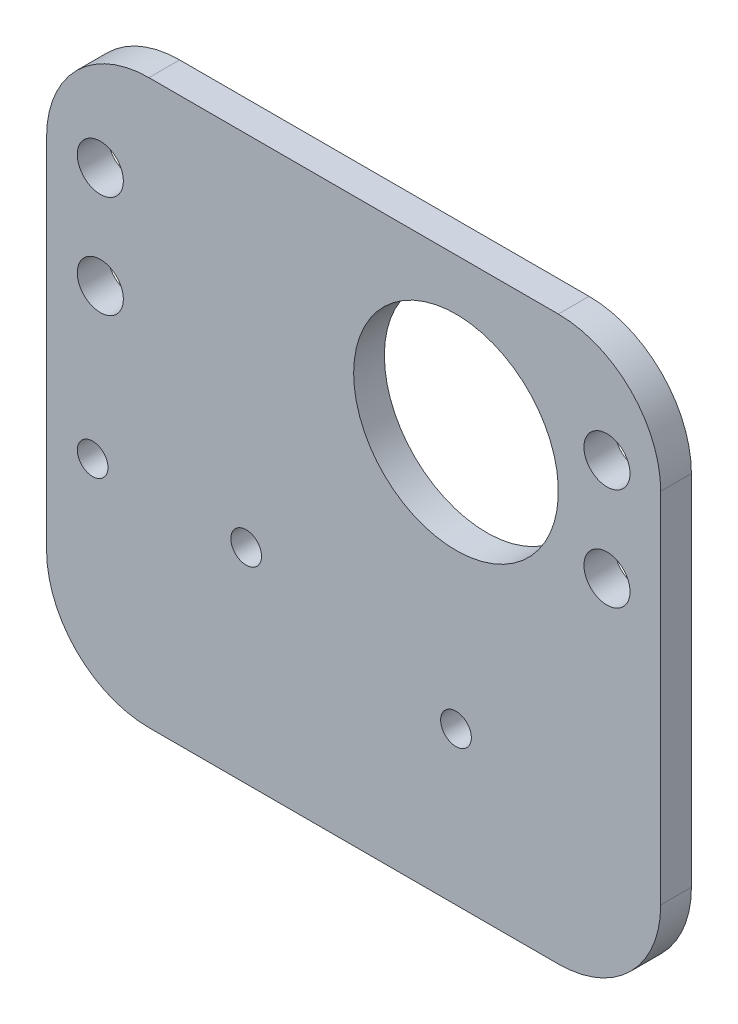
ISO-10303-21;
HEADER;
FILE_DESCRIPTION(('STEP AP214'),'2;1');
FILE_NAME('part.step','',(''),(''),'','','');
FILE_SCHEMA(('AUTOMOTIVE_DESIGN { 1 0 10303 214 1 1 1 1 }'));
ENDSEC;
DATA;
#1=APPLICATION_CONTEXT('core data for automotive mechanical design processes');
#2=APPLICATION_PROTOCOL_DEFINITION('international standard','automotive_design',2000,#1);
#3=PRODUCT_CONTEXT('',#1,'mechanical');
#4=PRODUCT('Part','Part','',(#3));
#5=PRODUCT_RELATED_PRODUCT_CATEGORY('part','',(#4));
#6=PRODUCT_DEFINITION_FORMATION('','',#4);
#7=PRODUCT_DEFINITION_CONTEXT('part definition',#1,'design');
#8=PRODUCT_DEFINITION('design','',#6,#7);
#9=PRODUCT_DEFINITION_SHAPE('','',#8);
#10=(LENGTH_UNIT() NAMED_UNIT(*) SI_UNIT(.MILLI.,.METRE.));
#11=(NAMED_UNIT(*) PLANE_ANGLE_UNIT() SI_UNIT($,.RADIAN.));
#12=(NAMED_UNIT(*) SI_UNIT($,.STERADIAN.) SOLID_ANGLE_UNIT());
#13=UNCERTAINTY_MEASURE_WITH_UNIT(LENGTH_MEASURE(1.E-05),#10,'distance_accuracy_value','');
#14=(GEOMETRIC_REPRESENTATION_CONTEXT(3) GLOBAL_UNCERTAINTY_ASSIGNED_CONTEXT((#13)) GLOBAL_UNIT_ASSIGNED_CONTEXT((#10,
#11,#12)) REPRESENTATION_CONTEXT('',''));
#15=CARTESIAN_POINT('',(0.,0.,0.));
#16=DIRECTION('',(0.,0.,1.));
#17=DIRECTION('',(1.,0.,0.));
#18=AXIS2_PLACEMENT_3D('',#15,#16,#17);
#19=CARTESIAN_POINT('',(0.,0.,0.001));
#20=DIRECTION('',(0.,0.,1.));
#21=DIRECTION('',(1.,0.,0.));
#22=AXIS2_PLACEMENT_3D('',#19,#20,#21);
#23=PLANE('',#22);
#24=CARTESIAN_POINT('',(45.5164785410153,-13.5674981786718,0.001));
#25=DIRECTION('',(0.,0.,-1.));
#26=DIRECTION('',(-1.,0.,0.));
#27=AXIS2_PLACEMENT_3D('',#24,#25,#26);
#28=CIRCLE('',#27,1.5);
#29=CARTESIAN_POINT('',(44.0164785410153,-13.5674981786718,0.001));
#30=VERTEX_POINT('',#29);
#31=EDGE_CURVE('E264',#30,#30,#28,.T.);
#32=ORIENTED_EDGE('',*,*,#31,.F.);
#33=EDGE_LOOP('',(#32));
#34=FACE_BOUND('',#33,.T.);
#35=CARTESIAN_POINT('',(45.5164785410153,-13.5674981786718,0.00100000000000013));
#36=DIRECTION('',(0.,0.,1.));
#37=DIRECTION('',(1.,0.,0.));
#38=AXIS2_PLACEMENT_3D('',#35,#36,#37);
#39=CIRCLE('',#38,5.5);
#40=CARTESIAN_POINT('',(51.0164785410153,-13.5674981786718,0.00100000000000013));
#41=VERTEX_POINT('',#40);
#42=EDGE_CURVE('E127',#41,#41,#39,.T.);
#43=ORIENTED_EDGE('',*,*,#42,.F.);
#44=EDGE_LOOP('',(#43));
#45=FACE_BOUND('',#44,.T.);
#46=ADVANCED_FACE('F35',(#34,#45),#23,.F.);
#47=CARTESIAN_POINT('',(45.5164785410153,-13.5674981786718,0.00100000000000013));
#48=DIRECTION('',(0.,0.,1.));
#49=DIRECTION('',(1.,0.,0.));
#50=AXIS2_PLACEMENT_3D('',#47,#48,#49);
#51=CIRCLE('',#50,7.5);
#52=CARTESIAN_POINT('',(53.0164785410153,-13.5674981786718,0.00100000000000013));
#53=VERTEX_POINT('',#52);
#54=EDGE_CURVE('E377',#53,#53,#51,.T.);
#55=ORIENTED_EDGE('',*,*,#54,.T.);
#56=EDGE_LOOP('',(#55));
#57=FACE_BOUND('',#56,.T.);
#58=CARTESIAN_POINT('',(10.0164785410153,-8.46749817867185,0.00100000000000013));
#59=DIRECTION('',(0.,0.,1.));
#60=DIRECTION('',(1.,0.,0.));
#61=AXIS2_PLACEMENT_3D('',#58,#59,#60);
#62=CIRCLE('',#61,1.5);
#63=CARTESIAN_POINT('',(11.5164785410153,-8.46749817867185,0.00100000000000013));
#64=VERTEX_POINT('',#63);
#65=EDGE_CURVE('E270',#64,#64,#62,.T.);
#66=ORIENTED_EDGE('',*,*,#65,.T.);
#67=EDGE_LOOP('',(#66));
#68=FACE_BOUND('',#67,.T.);
#69=CARTESIAN_POINT('',(25.0164785410153,-8.46749817867185,0.00100000000000013));
#70=DIRECTION('',(0.,0.,1.));
#71=DIRECTION('',(1.,0.,0.));
#72=AXIS2_PLACEMENT_3D('',#69,#70,#71);
#73=CIRCLE('',#72,1.5);
#74=CARTESIAN_POINT('',(26.5164785410153,-8.46749817867185,0.00100000000000013));
#75=VERTEX_POINT('',#74);
#76=EDGE_CURVE('E385',#75,#75,#73,.T.);
#77=ORIENTED_EDGE('',*,*,#76,.T.);
#78=EDGE_LOOP('',(#77));
#79=FACE_BOUND('',#78,.T.);
#80=CARTESIAN_POINT('',(45.5164785410153,11.5325018213282,0.001));
#81=DIRECTION('',(0.,0.,-1.));
#82=DIRECTION('',(-1.,0.,0.));
#83=AXIS2_PLACEMENT_3D('',#80,#81,#82);
#84=CIRCLE('',#83,10.);
#85=CARTESIAN_POINT('',(35.5164785410153,11.5325018213282,0.001));
#86=VERTEX_POINT('',#85);
#87=EDGE_CURVE('E263',#86,#86,#84,.T.);
#88=ORIENTED_EDGE('',*,*,#87,.F.);
#89=EDGE_LOOP('',(#88));
#90=FACE_BOUND('',#89,.T.);
#91=CARTESIAN_POINT('',(60.2664785410153,6.53250182132816,0.001));
#92=DIRECTION('',(0.,0.,1.));
#93=DIRECTION('',(1.,0.,0.));
#94=AXIS2_PLACEMENT_3D('',#91,#92,#93);
#95=CIRCLE('',#94,3.00000000000002);
#96=CARTESIAN_POINT('',(63.2664785410153,6.53250182132816,0.001));
#97=VERTEX_POINT('',#96);
#98=EDGE_CURVE('E187',#97,#97,#95,.F.);
#99=ORIENTED_EDGE('',*,*,#98,.F.);
#100=EDGE_LOOP('',(#99));
#101=FACE_BOUND('',#100,.T.);
#102=DIRECTION('',(1.,0.,0.));
#103=VECTOR('',#102,1.);
#104=CARTESIAN_POINT('',(5.51647854101529,26.5325018213282,0.001));
#105=LINE('',#104,#103);
#106=CARTESIAN_POINT('',(15.5164785410153,26.5325018213282,0.001));
#107=VERTEX_POINT('',#106);
#108=CARTESIAN_POINT('',(55.5164785410153,26.5325018213282,0.001));
#109=VERTEX_POINT('',#108);
#110=EDGE_CURVE('E105',#107,#109,#105,.T.);
#111=ORIENTED_EDGE('',*,*,#110,.T.);
#112=CARTESIAN_POINT('',(55.5164785410153,16.5325018213282,0.00100000000000013));
#113=DIRECTION('',(0.,0.,1.));
#114=DIRECTION('',(1.,0.,0.));
#115=AXIS2_PLACEMENT_3D('',#112,#113,#114);
#116=CIRCLE('',#115,10.);
#117=CARTESIAN_POINT('',(65.5164785410153,16.5325018213282,0.001));
#118=VERTEX_POINT('',#117);
#119=EDGE_CURVE('E139',#109,#118,#116,.F.);
#120=ORIENTED_EDGE('',*,*,#119,.T.);
#121=DIRECTION('',(0.,-1.,0.));
#122=VECTOR('',#121,1.);
#123=CARTESIAN_POINT('',(65.5164785410153,26.5325018213282,0.001));
#124=LINE('',#123,#122);
#125=CARTESIAN_POINT('',(65.5164785410153,-18.4674981786718,0.001));
#126=VERTEX_POINT('',#125);
#127=EDGE_CURVE('E123',#118,#126,#124,.T.);
#128=ORIENTED_EDGE('',*,*,#127,.T.);
#129=CARTESIAN_POINT('',(55.5164785410153,-18.4674981786718,0.00100000000000013));
#130=DIRECTION('',(0.,0.,1.));
#131=DIRECTION('',(1.,0.,0.));
#132=AXIS2_PLACEMENT_3D('',#129,#130,#131);
#133=CIRCLE('',#132,10.);
#134=CARTESIAN_POINT('',(55.5164785410153,-28.4674981786718,0.001));
#135=VERTEX_POINT('',#134);
#136=EDGE_CURVE('E137',#126,#135,#133,.F.);
#137=ORIENTED_EDGE('',*,*,#136,.T.);
#138=DIRECTION('',(1.,0.,0.));
#139=VECTOR('',#138,1.);
#140=CARTESIAN_POINT('',(5.51647854101529,-28.4674981786718,0.001));
#141=LINE('',#140,#139);
#142=CARTESIAN_POINT('',(15.5164785410153,-28.4674981786718,0.001));
#143=VERTEX_POINT('',#142);
#144=EDGE_CURVE('E173',#143,#135,#141,.T.);
#145=ORIENTED_EDGE('',*,*,#144,.F.);
#146=CARTESIAN_POINT('',(15.5164785410153,-18.4674981786718,0.00100000000000013));
#147=DIRECTION('',(0.,0.,1.));
#148=DIRECTION('',(1.,0.,0.));
#149=AXIS2_PLACEMENT_3D('',#146,#147,#148);
#150=CIRCLE('',#149,10.);
#151=CARTESIAN_POINT('',(5.51647854101529,-18.4674981786718,0.001));
#152=VERTEX_POINT('',#151);
#153=EDGE_CURVE('E112',#143,#152,#150,.F.);
#154=ORIENTED_EDGE('',*,*,#153,.T.);
#155=DIRECTION('',(0.,-1.,0.));
#156=VECTOR('',#155,1.);
#157=CARTESIAN_POINT('',(5.51647854101529,1.53250182132815,0.001));
#158=LINE('',#157,#156);
#159=CARTESIAN_POINT('',(5.51647854101529,16.5325018213281,0.001));
#160=VERTEX_POINT('',#159);
#161=EDGE_CURVE('E107',#160,#152,#158,.T.);
#162=ORIENTED_EDGE('',*,*,#161,.F.);
#163=CARTESIAN_POINT('',(15.5164785410153,16.5325018213282,0.00100000000000013));
#164=DIRECTION('',(0.,0.,1.));
#165=DIRECTION('',(1.,0.,0.));
#166=AXIS2_PLACEMENT_3D('',#163,#164,#165);
#167=CIRCLE('',#166,10.);
#168=EDGE_CURVE('E101',#160,#107,#167,.F.);
#169=ORIENTED_EDGE('',*,*,#168,.T.);
#170=EDGE_LOOP('',(#111,#120,#128,#137,#145,#154,#162,#169));
#171=FACE_BOUND('',#170,.T.);
#172=CARTESIAN_POINT('',(10.7664785410153,6.53250182132816,0.001));
#173=DIRECTION('',(0.,0.,1.));
#174=DIRECTION('',(1.,0.,0.));
#175=AXIS2_PLACEMENT_3D('',#172,#173,#174);
#176=CIRCLE('',#175,3.);
#177=CARTESIAN_POINT('',(13.7664785410153,6.53250182132816,0.001));
#178=VERTEX_POINT('',#177);
#179=EDGE_CURVE('E180',#178,#178,#176,.T.);
#180=ORIENTED_EDGE('',*,*,#179,.T.);
#181=EDGE_LOOP('',(#180));
#182=FACE_BOUND('',#181,.T.);
#183=CARTESIAN_POINT('',(60.2664785410153,16.5325018213282,0.001));
#184=DIRECTION('',(0.,0.,1.));
#185=DIRECTION('',(1.,0.,0.));
#186=AXIS2_PLACEMENT_3D('',#183,#184,#185);
#187=CIRCLE('',#186,3.00000000000002);
#188=CARTESIAN_POINT('',(63.2664785410153,16.5325018213282,0.001));
#189=VERTEX_POINT('',#188);
#190=EDGE_CURVE('E183',#189,#189,#187,.F.);
#191=ORIENTED_EDGE('',*,*,#190,.F.);
#192=EDGE_LOOP('',(#191));
#193=FACE_BOUND('',#192,.T.);
#194=CARTESIAN_POINT('',(10.7664785410153,16.5325018213282,0.001));
#195=DIRECTION('',(0.,0.,1.));
#196=DIRECTION('',(1.,0.,0.));
#197=AXIS2_PLACEMENT_3D('',#194,#195,#196);
#198=CIRCLE('',#197,3.);
#199=CARTESIAN_POINT('',(13.7664785410153,16.5325018213282,0.001));
#200=VERTEX_POINT('',#199);
#201=EDGE_CURVE('E131',#200,#200,#198,.F.);
#202=ORIENTED_EDGE('',*,*,#201,.F.);
#203=EDGE_LOOP('',(#202));
#204=FACE_BOUND('',#203,.T.);
#205=ADVANCED_FACE('F103',(#57,#68,#79,#90,#101,#171,#182,#193,#204),#23,.F.);
#206=CARTESIAN_POINT('',(10.7664785410153,6.53250182132816,0.001));
#207=DIRECTION('',(0.,0.,-1.));
#208=DIRECTION('',(-1.,0.,0.));
#209=AXIS2_PLACEMENT_3D('',#206,#207,#208);
#210=CYLINDRICAL_SURFACE('',#209,3.);
#211=ORIENTED_EDGE('',*,*,#179,.F.);
#212=EDGE_LOOP('',(#211));
#213=FACE_BOUND('',#212,.T.);
#214=CARTESIAN_POINT('',(10.7664785410153,6.53250182132816,0.));
#215=DIRECTION('',(0.,0.,1.));
#216=DIRECTION('',(1.,0.,0.));
#217=AXIS2_PLACEMENT_3D('',#214,#215,#216);
#218=CIRCLE('',#217,3.);
#219=CARTESIAN_POINT('',(13.7664785410153,6.53250182132816,0.));
#220=VERTEX_POINT('',#219);
#221=EDGE_CURVE('E179',#220,#220,#218,.T.);
#222=ORIENTED_EDGE('',*,*,#221,.T.);
#223=EDGE_LOOP('',(#222));
#224=FACE_BOUND('',#223,.T.);
#225=ADVANCED_FACE('F198',(#213,#224),#210,.T.);
#226=CARTESIAN_POINT('',(10.7664785410153,6.53250182132816,0.));
#227=DIRECTION('',(0.,0.,1.));
#228=DIRECTION('',(1.,0.,0.));
#229=AXIS2_PLACEMENT_3D('',#226,#227,#228);
#230=PLANE('',#229);
#231=CARTESIAN_POINT('',(10.7664785410153,6.53250182132816,0.));
#232=DIRECTION('',(0.,0.,1.));
#233=DIRECTION('',(1.,0.,0.));
#234=AXIS2_PLACEMENT_3D('',#231,#232,#233);
#235=CIRCLE('',#234,2.25);
#236=CARTESIAN_POINT('',(13.0164785410153,6.53250182132816,0.));
#237=VERTEX_POINT('',#236);
#238=EDGE_CURVE('E171',#237,#237,#235,.T.);
#239=ORIENTED_EDGE('',*,*,#238,.T.);
#240=EDGE_LOOP('',(#239));
#241=FACE_BOUND('',#240,.T.);
#242=ORIENTED_EDGE('',*,*,#221,.F.);
#243=EDGE_LOOP('',(#242));
#244=FACE_BOUND('',#243,.T.);
#245=ADVANCED_FACE('F205',(#241,#244),#230,.F.);
#246=CARTESIAN_POINT('',(10.7664785410153,6.53250182132816,0.));
#247=DIRECTION('',(0.,0.,1.));
#248=DIRECTION('',(1.,0.,0.));
#249=AXIS2_PLACEMENT_3D('',#246,#247,#248);
#250=CYLINDRICAL_SURFACE('',#249,2.25);
#251=ORIENTED_EDGE('',*,*,#238,.F.);
#252=EDGE_LOOP('',(#251));
#253=FACE_BOUND('',#252,.T.);
#254=CARTESIAN_POINT('',(10.7664785410153,6.53250182132816,3.001));
#255=DIRECTION('',(0.,0.,-1.));
#256=DIRECTION('',(-1.,0.,0.));
#257=AXIS2_PLACEMENT_3D('',#254,#255,#256);
#258=CIRCLE('',#257,2.25);
#259=CARTESIAN_POINT('',(8.51647854101528,6.53250182132816,3.001));
#260=VERTEX_POINT('',#259);
#261=EDGE_CURVE('E278',#260,#260,#258,.T.);
#262=ORIENTED_EDGE('',*,*,#261,.F.);
#263=EDGE_LOOP('',(#262));
#264=FACE_BOUND('',#263,.T.);
#265=ADVANCED_FACE('F227',(#253,#264),#250,.F.);
#266=CARTESIAN_POINT('',(0.,0.,3.001));
#267=DIRECTION('',(0.,0.,1.));
#268=DIRECTION('',(1.,0.,0.));
#269=AXIS2_PLACEMENT_3D('',#266,#267,#268);
#270=PLANE('',#269);
#271=CARTESIAN_POINT('',(10.0164785410153,-8.46749817867185,3.001));
#272=DIRECTION('',(0.,0.,1.));
#273=DIRECTION('',(1.,0.,0.));
#274=AXIS2_PLACEMENT_3D('',#271,#272,#273);
#275=CIRCLE('',#274,1.5);
#276=CARTESIAN_POINT('',(11.5164785410153,-8.46749817867185,3.001));
#277=VERTEX_POINT('',#276);
#278=EDGE_CURVE('E382',#277,#277,#275,.T.);
#279=ORIENTED_EDGE('',*,*,#278,.F.);
#280=EDGE_LOOP('',(#279));
#281=FACE_BOUND('',#280,.T.);
#282=CARTESIAN_POINT('',(25.0164785410153,-8.46749817867185,3.001));
#283=DIRECTION('',(0.,0.,1.));
#284=DIRECTION('',(1.,0.,0.));
#285=AXIS2_PLACEMENT_3D('',#282,#283,#284);
#286=CIRCLE('',#285,1.5);
#287=CARTESIAN_POINT('',(26.5164785410153,-8.46749817867185,3.001));
#288=VERTEX_POINT('',#287);
#289=EDGE_CURVE('E381',#288,#288,#286,.T.);
#290=ORIENTED_EDGE('',*,*,#289,.F.);
#291=EDGE_LOOP('',(#290));
#292=FACE_BOUND('',#291,.T.);
#293=CARTESIAN_POINT('',(60.2664785410153,16.5325018213282,3.001));
#294=DIRECTION('',(0.,0.,-1.));
#295=DIRECTION('',(-1.,0.,0.));
#296=AXIS2_PLACEMENT_3D('',#293,#294,#295);
#297=CIRCLE('',#296,2.25);
#298=CARTESIAN_POINT('',(58.0164785410153,16.5325018213282,3.001));
#299=VERTEX_POINT('',#298);
#300=EDGE_CURVE('E281',#299,#299,#297,.T.);
#301=ORIENTED_EDGE('',*,*,#300,.T.);
#302=EDGE_LOOP('',(#301));
#303=FACE_BOUND('',#302,.T.);
#304=ORIENTED_EDGE('',*,*,#261,.T.);
#305=EDGE_LOOP('',(#304));
#306=FACE_BOUND('',#305,.T.);
#307=CARTESIAN_POINT('',(10.7664785410153,16.5325018213282,3.001));
#308=DIRECTION('',(0.,0.,-1.));
#309=DIRECTION('',(-1.,0.,0.));
#310=AXIS2_PLACEMENT_3D('',#307,#308,#309);
#311=CIRCLE('',#310,2.25);
#312=CARTESIAN_POINT('',(8.51647854101528,16.5325018213282,3.001));
#313=VERTEX_POINT('',#312);
#314=EDGE_CURVE('E275',#313,#313,#311,.T.);
#315=ORIENTED_EDGE('',*,*,#314,.T.);
#316=EDGE_LOOP('',(#315));
#317=FACE_BOUND('',#316,.T.);
#318=CARTESIAN_POINT('',(45.5164785410153,11.5325018213282,3.001));
#319=DIRECTION('',(0.,0.,-1.));
#320=DIRECTION('',(-1.,0.,0.));
#321=AXIS2_PLACEMENT_3D('',#318,#319,#320);
#322=CIRCLE('',#321,10.);
#323=CARTESIAN_POINT('',(35.5164785410153,11.5325018213282,3.001));
#324=VERTEX_POINT('',#323);
#325=EDGE_CURVE('E267',#324,#324,#322,.T.);
#326=ORIENTED_EDGE('',*,*,#325,.T.);
#327=EDGE_LOOP('',(#326));
#328=FACE_BOUND('',#327,.T.);
#329=CARTESIAN_POINT('',(60.2664785410153,6.53250182132816,3.001));
#330=DIRECTION('',(0.,0.,-1.));
#331=DIRECTION('',(-1.,0.,0.));
#332=AXIS2_PLACEMENT_3D('',#329,#330,#331);
#333=CIRCLE('',#332,2.25);
#334=CARTESIAN_POINT('',(58.0164785410153,6.53250182132816,3.001));
#335=VERTEX_POINT('',#334);
#336=EDGE_CURVE('E284',#335,#335,#333,.T.);
#337=ORIENTED_EDGE('',*,*,#336,.T.);
#338=EDGE_LOOP('',(#337));
#339=FACE_BOUND('',#338,.T.);
#340=DIRECTION('',(0.,-1.,0.));
#341=VECTOR('',#340,1.);
#342=CARTESIAN_POINT('',(65.5164785410153,26.5325018213282,3.001));
#343=LINE('',#342,#341);
#344=CARTESIAN_POINT('',(65.5164785410153,16.5325018213282,3.001));
#345=VERTEX_POINT('',#344);
#346=CARTESIAN_POINT('',(65.5164785410153,-18.4674981786718,3.001));
#347=VERTEX_POINT('',#346);
#348=EDGE_CURVE('E161',#345,#347,#343,.T.);
#349=ORIENTED_EDGE('',*,*,#348,.F.);
#350=CARTESIAN_POINT('',(55.5164785410153,16.5325018213282,3.001));
#351=DIRECTION('',(0.,0.,1.));
#352=DIRECTION('',(1.,0.,0.));
#353=AXIS2_PLACEMENT_3D('',#350,#351,#352);
#354=CIRCLE('',#353,10.);
#355=CARTESIAN_POINT('',(55.5164785410153,26.5325018213282,3.001));
#356=VERTEX_POINT('',#355);
#357=EDGE_CURVE('E150',#345,#356,#354,.T.);
#358=ORIENTED_EDGE('',*,*,#357,.T.);
#359=DIRECTION('',(1.,0.,0.));
#360=VECTOR('',#359,1.);
#361=CARTESIAN_POINT('',(5.51647854101529,26.5325018213282,3.001));
#362=LINE('',#361,#360);
#363=CARTESIAN_POINT('',(15.5164785410153,26.5325018213282,3.001));
#364=VERTEX_POINT('',#363);
#365=EDGE_CURVE('E169',#364,#356,#362,.T.);
#366=ORIENTED_EDGE('',*,*,#365,.F.);
#367=CARTESIAN_POINT('',(15.5164785410153,16.5325018213282,3.001));
#368=DIRECTION('',(0.,0.,1.));
#369=DIRECTION('',(1.,0.,0.));
#370=AXIS2_PLACEMENT_3D('',#367,#368,#369);
#371=CIRCLE('',#370,10.);
#372=CARTESIAN_POINT('',(5.51647854101529,16.5325018213282,3.001));
#373=VERTEX_POINT('',#372);
#374=EDGE_CURVE('E126',#364,#373,#371,.T.);
#375=ORIENTED_EDGE('',*,*,#374,.T.);
#376=DIRECTION('',(0.,-1.,0.));
#377=VECTOR('',#376,1.);
#378=CARTESIAN_POINT('',(5.51647854101529,26.5325018213282,3.001));
#379=LINE('',#378,#377);
#380=CARTESIAN_POINT('',(5.51647854101529,-18.4674981786718,3.001));
#381=VERTEX_POINT('',#380);
#382=EDGE_CURVE('E122',#373,#381,#379,.T.);
#383=ORIENTED_EDGE('',*,*,#382,.T.);
#384=CARTESIAN_POINT('',(15.5164785410153,-18.4674981786718,3.001));
#385=DIRECTION('',(0.,0.,1.));
#386=DIRECTION('',(1.,0.,0.));
#387=AXIS2_PLACEMENT_3D('',#384,#385,#386);
#388=CIRCLE('',#387,10.);
#389=CARTESIAN_POINT('',(15.5164785410153,-28.4674981786718,3.001));
#390=VERTEX_POINT('',#389);
#391=EDGE_CURVE('E57',#381,#390,#388,.T.);
#392=ORIENTED_EDGE('',*,*,#391,.T.);
#393=DIRECTION('',(1.,0.,0.));
#394=VECTOR('',#393,1.);
#395=CARTESIAN_POINT('',(5.51647854101529,-28.4674981786718,3.001));
#396=LINE('',#395,#394);
#397=CARTESIAN_POINT('',(55.5164785410153,-28.4674981786718,3.001));
#398=VERTEX_POINT('',#397);
#399=EDGE_CURVE('E159',#390,#398,#396,.T.);
#400=ORIENTED_EDGE('',*,*,#399,.T.);
#401=CARTESIAN_POINT('',(55.5164785410153,-18.4674981786718,3.001));
#402=DIRECTION('',(0.,0.,1.));
#403=DIRECTION('',(1.,0.,0.));
#404=AXIS2_PLACEMENT_3D('',#401,#402,#403);
#405=CIRCLE('',#404,10.);
#406=EDGE_CURVE('E148',#398,#347,#405,.T.);
#407=ORIENTED_EDGE('',*,*,#406,.T.);
#408=EDGE_LOOP('',(#349,#358,#366,#375,#383,#392,#400,#407));
#409=FACE_BOUND('',#408,.T.);
#410=CARTESIAN_POINT('',(45.5164785410153,-13.5674981786718,3.001));
#411=DIRECTION('',(0.,0.,-1.));
#412=DIRECTION('',(-1.,0.,0.));
#413=AXIS2_PLACEMENT_3D('',#410,#411,#412);
#414=CIRCLE('',#413,1.5);
#415=CARTESIAN_POINT('',(44.0164785410153,-13.5674981786718,3.001));
#416=VERTEX_POINT('',#415);
#417=EDGE_CURVE('E261',#416,#416,#414,.T.);
#418=ORIENTED_EDGE('',*,*,#417,.T.);
#419=EDGE_LOOP('',(#418));
#420=FACE_BOUND('',#419,.T.);
#421=ADVANCED_FACE('F213',(#281,#292,#303,#306,#317,#328,#339,#409,#420),#270,.T.);
#422=CARTESIAN_POINT('',(5.51647854101529,26.5325018213282,3.001));
#423=DIRECTION('',(0.,1.,0.));
#424=DIRECTION('',(0.,0.,1.));
#425=AXIS2_PLACEMENT_3D('',#422,#423,#424);
#426=PLANE('',#425);
#427=ORIENTED_EDGE('',*,*,#365,.T.);
#428=DIRECTION('',(0.,0.,-1.));
#429=VECTOR('',#428,1.);
#430=CARTESIAN_POINT('',(55.5164785410153,26.5325018213282,3.001));
#431=LINE('',#430,#429);
#432=EDGE_CURVE('E113',#356,#109,#431,.T.);
#433=ORIENTED_EDGE('',*,*,#432,.T.);
#434=ORIENTED_EDGE('',*,*,#110,.F.);
#435=DIRECTION('',(0.,0.,-1.));
#436=VECTOR('',#435,1.);
#437=CARTESIAN_POINT('',(15.5164785410153,26.5325018213282,3.001));
#438=LINE('',#437,#436);
#439=EDGE_CURVE('E119',#107,#364,#438,.F.);
#440=ORIENTED_EDGE('',*,*,#439,.T.);
#441=EDGE_LOOP('',(#427,#433,#434,#440));
#442=FACE_BOUND('',#441,.T.);
#443=ADVANCED_FACE('F118',(#442),#426,.T.);
#444=CARTESIAN_POINT('',(65.5164785410153,26.5325018213282,3.001));
#445=DIRECTION('',(1.,0.,0.));
#446=DIRECTION('',(0.,0.,-1.));
#447=AXIS2_PLACEMENT_3D('',#444,#445,#446);
#448=PLANE('',#447);
#449=ORIENTED_EDGE('',*,*,#127,.F.);
#450=DIRECTION('',(0.,0.,-1.));
#451=VECTOR('',#450,1.);
#452=CARTESIAN_POINT('',(65.5164785410153,16.5325018213282,3.001));
#453=LINE('',#452,#451);
#454=EDGE_CURVE('E144',#118,#345,#453,.F.);
#455=ORIENTED_EDGE('',*,*,#454,.T.);
#456=ORIENTED_EDGE('',*,*,#348,.T.);
#457=DIRECTION('',(0.,0.,-1.));
#458=VECTOR('',#457,1.);
#459=CARTESIAN_POINT('',(65.5164785410153,-18.4674981786718,0.00100000000000013));
#460=LINE('',#459,#458);
#461=EDGE_CURVE('E141',#347,#126,#460,.T.);
#462=ORIENTED_EDGE('',*,*,#461,.T.);
#463=EDGE_LOOP('',(#449,#455,#456,#462));
#464=FACE_BOUND('',#463,.T.);
#465=ADVANCED_FACE('F217',(#464),#448,.T.);
#466=CARTESIAN_POINT('',(5.51647854101529,-28.4674981786718,3.001));
#467=DIRECTION('',(0.,1.,0.));
#468=DIRECTION('',(0.,0.,1.));
#469=AXIS2_PLACEMENT_3D('',#466,#467,#468);
#470=PLANE('',#469);
#471=ORIENTED_EDGE('',*,*,#144,.T.);
#472=DIRECTION('',(0.,0.,-1.));
#473=VECTOR('',#472,1.);
#474=CARTESIAN_POINT('',(55.5164785410153,-28.4674981786718,3.001));
#475=LINE('',#474,#473);
#476=EDGE_CURVE('E50',#135,#398,#475,.F.);
#477=ORIENTED_EDGE('',*,*,#476,.T.);
#478=ORIENTED_EDGE('',*,*,#399,.F.);
#479=DIRECTION('',(0.,0.,-1.));
#480=VECTOR('',#479,1.);
#481=CARTESIAN_POINT('',(15.5164785410153,-28.4674981786718,3.001));
#482=LINE('',#481,#480);
#483=EDGE_CURVE('E152',#390,#143,#482,.T.);
#484=ORIENTED_EDGE('',*,*,#483,.T.);
#485=EDGE_LOOP('',(#471,#477,#478,#484));
#486=FACE_BOUND('',#485,.T.);
#487=ADVANCED_FACE('F220',(#486),#470,.F.);
#488=CARTESIAN_POINT('',(5.51647854101529,1.53250182132815,3.001));
#489=DIRECTION('',(1.,0.,0.));
#490=DIRECTION('',(0.,0.,-1.));
#491=AXIS2_PLACEMENT_3D('',#488,#489,#490);
#492=PLANE('',#491);
#493=ORIENTED_EDGE('',*,*,#161,.T.);
#494=DIRECTION('',(0.,0.,-1.));
#495=VECTOR('',#494,1.);
#496=CARTESIAN_POINT('',(5.51647854101529,-18.4674981786718,3.001));
#497=LINE('',#496,#495);
#498=EDGE_CURVE('E11',#152,#381,#497,.F.);
#499=ORIENTED_EDGE('',*,*,#498,.T.);
#500=ORIENTED_EDGE('',*,*,#382,.F.);
#501=DIRECTION('',(0.,0.,-1.));
#502=VECTOR('',#501,1.);
#503=CARTESIAN_POINT('',(5.51647854101529,16.5325018213282,0.00100000000000013));
#504=LINE('',#503,#502);
#505=EDGE_CURVE('E43',#373,#160,#504,.T.);
#506=ORIENTED_EDGE('',*,*,#505,.T.);
#507=EDGE_LOOP('',(#493,#499,#500,#506));
#508=FACE_BOUND('',#507,.T.);
#509=ADVANCED_FACE('F157',(#508),#492,.F.);
#510=CARTESIAN_POINT('',(60.2664785410153,16.5325018213282,0.001));
#511=DIRECTION('',(0.,0.,-1.));
#512=DIRECTION('',(-1.,0.,0.));
#513=AXIS2_PLACEMENT_3D('',#510,#511,#512);
#514=CYLINDRICAL_SURFACE('',#513,3.00000000000002);
#515=ORIENTED_EDGE('',*,*,#190,.T.);
#516=EDGE_LOOP('',(#515));
#517=FACE_BOUND('',#516,.T.);
#518=CARTESIAN_POINT('',(60.2664785410153,16.5325018213282,0.));
#519=DIRECTION('',(0.,0.,1.));
#520=DIRECTION('',(1.,0.,0.));
#521=AXIS2_PLACEMENT_3D('',#518,#519,#520);
#522=CIRCLE('',#521,3.00000000000002);
#523=CARTESIAN_POINT('',(63.2664785410153,16.5325018213282,0.));
#524=VERTEX_POINT('',#523);
#525=EDGE_CURVE('E164',#524,#524,#522,.T.);
#526=ORIENTED_EDGE('',*,*,#525,.T.);
#527=EDGE_LOOP('',(#526));
#528=FACE_BOUND('',#527,.T.);
#529=ADVANCED_FACE('F226',(#517,#528),#514,.T.);
#530=CARTESIAN_POINT('',(60.2664785410153,16.5325018213282,0.));
#531=DIRECTION('',(0.,0.,1.));
#532=DIRECTION('',(1.,0.,0.));
#533=AXIS2_PLACEMENT_3D('',#530,#531,#532);
#534=PLANE('',#533);
#535=CARTESIAN_POINT('',(60.2664785410153,16.5325018213282,0.));
#536=DIRECTION('',(0.,0.,1.));
#537=DIRECTION('',(1.,0.,0.));
#538=AXIS2_PLACEMENT_3D('',#535,#536,#537);
#539=CIRCLE('',#538,2.25);
#540=CARTESIAN_POINT('',(62.5164785410153,16.5325018213282,0.));
#541=VERTEX_POINT('',#540);
#542=EDGE_CURVE('E300',#541,#541,#539,.T.);
#543=ORIENTED_EDGE('',*,*,#542,.T.);
#544=EDGE_LOOP('',(#543));
#545=FACE_BOUND('',#544,.T.);
#546=ORIENTED_EDGE('',*,*,#525,.F.);
#547=EDGE_LOOP('',(#546));
#548=FACE_BOUND('',#547,.T.);
#549=ADVANCED_FACE('F308',(#545,#548),#534,.F.);
#550=CARTESIAN_POINT('',(60.2664785410153,16.5325018213282,0.));
#551=DIRECTION('',(0.,0.,1.));
#552=DIRECTION('',(1.,0.,0.));
#553=AXIS2_PLACEMENT_3D('',#550,#551,#552);
#554=CYLINDRICAL_SURFACE('',#553,2.25);
#555=ORIENTED_EDGE('',*,*,#542,.F.);
#556=EDGE_LOOP('',(#555));
#557=FACE_BOUND('',#556,.T.);
#558=ORIENTED_EDGE('',*,*,#300,.F.);
#559=EDGE_LOOP('',(#558));
#560=FACE_BOUND('',#559,.T.);
#561=ADVANCED_FACE('F310',(#557,#560),#554,.F.);
#562=CARTESIAN_POINT('',(60.2664785410153,6.53250182132816,0.001));
#563=DIRECTION('',(0.,0.,-1.));
#564=DIRECTION('',(-1.,0.,0.));
#565=AXIS2_PLACEMENT_3D('',#562,#563,#564);
#566=CYLINDRICAL_SURFACE('',#565,3.00000000000002);
#567=ORIENTED_EDGE('',*,*,#98,.T.);
#568=EDGE_LOOP('',(#567));
#569=FACE_BOUND('',#568,.T.);
#570=CARTESIAN_POINT('',(60.2664785410153,6.53250182132816,0.));
#571=DIRECTION('',(0.,0.,1.));
#572=DIRECTION('',(1.,0.,0.));
#573=AXIS2_PLACEMENT_3D('',#570,#571,#572);
#574=CIRCLE('',#573,3.00000000000002);
#575=CARTESIAN_POINT('',(63.2664785410153,6.53250182132816,0.));
#576=VERTEX_POINT('',#575);
#577=EDGE_CURVE('E298',#576,#576,#574,.T.);
#578=ORIENTED_EDGE('',*,*,#577,.T.);
#579=EDGE_LOOP('',(#578));
#580=FACE_BOUND('',#579,.T.);
#581=ADVANCED_FACE('F315',(#569,#580),#566,.T.);
#582=CARTESIAN_POINT('',(60.2664785410153,6.53250182132816,0.));
#583=DIRECTION('',(0.,0.,1.));
#584=DIRECTION('',(1.,0.,0.));
#585=AXIS2_PLACEMENT_3D('',#582,#583,#584);
#586=PLANE('',#585);
#587=CARTESIAN_POINT('',(60.2664785410153,6.53250182132816,0.));
#588=DIRECTION('',(0.,0.,1.));
#589=DIRECTION('',(1.,0.,0.));
#590=AXIS2_PLACEMENT_3D('',#587,#588,#589);
#591=CIRCLE('',#590,2.25);
#592=CARTESIAN_POINT('',(62.5164785410153,6.53250182132816,0.));
#593=VERTEX_POINT('',#592);
#594=EDGE_CURVE('E295',#593,#593,#591,.T.);
#595=ORIENTED_EDGE('',*,*,#594,.T.);
#596=EDGE_LOOP('',(#595));
#597=FACE_BOUND('',#596,.T.);
#598=ORIENTED_EDGE('',*,*,#577,.F.);
#599=EDGE_LOOP('',(#598));
#600=FACE_BOUND('',#599,.T.);
#601=ADVANCED_FACE('F321',(#597,#600),#586,.F.);
#602=CARTESIAN_POINT('',(60.2664785410153,6.53250182132816,0.));
#603=DIRECTION('',(0.,0.,1.));
#604=DIRECTION('',(1.,0.,0.));
#605=AXIS2_PLACEMENT_3D('',#602,#603,#604);
#606=CYLINDRICAL_SURFACE('',#605,2.25);
#607=ORIENTED_EDGE('',*,*,#594,.F.);
#608=EDGE_LOOP('',(#607));
#609=FACE_BOUND('',#608,.T.);
#610=ORIENTED_EDGE('',*,*,#336,.F.);
#611=EDGE_LOOP('',(#610));
#612=FACE_BOUND('',#611,.T.);
#613=ADVANCED_FACE('F324',(#609,#612),#606,.F.);
#614=CARTESIAN_POINT('',(10.7664785410153,16.5325018213282,0.001));
#615=DIRECTION('',(0.,0.,-1.));
#616=DIRECTION('',(-1.,0.,0.));
#617=AXIS2_PLACEMENT_3D('',#614,#615,#616);
#618=CYLINDRICAL_SURFACE('',#617,3.);
#619=ORIENTED_EDGE('',*,*,#201,.T.);
#620=EDGE_LOOP('',(#619));
#621=FACE_BOUND('',#620,.T.);
#622=CARTESIAN_POINT('',(10.7664785410153,16.5325018213282,0.));
#623=DIRECTION('',(0.,0.,1.));
#624=DIRECTION('',(1.,0.,0.));
#625=AXIS2_PLACEMENT_3D('',#622,#623,#624);
#626=CIRCLE('',#625,3.);
#627=CARTESIAN_POINT('',(13.7664785410153,16.5325018213282,0.));
#628=VERTEX_POINT('',#627);
#629=EDGE_CURVE('E292',#628,#628,#626,.T.);
#630=ORIENTED_EDGE('',*,*,#629,.T.);
#631=EDGE_LOOP('',(#630));
#632=FACE_BOUND('',#631,.T.);
#633=ADVANCED_FACE('F194',(#621,#632),#618,.T.);
#634=CARTESIAN_POINT('',(10.7664785410153,16.5325018213282,0.));
#635=DIRECTION('',(0.,0.,1.));
#636=DIRECTION('',(1.,0.,0.));
#637=AXIS2_PLACEMENT_3D('',#634,#635,#636);
#638=PLANE('',#637);
#639=CARTESIAN_POINT('',(10.7664785410153,16.5325018213282,0.));
#640=DIRECTION('',(0.,0.,1.));
#641=DIRECTION('',(1.,0.,0.));
#642=AXIS2_PLACEMENT_3D('',#639,#640,#641);
#643=CIRCLE('',#642,2.25);
#644=CARTESIAN_POINT('',(13.0164785410153,16.5325018213282,0.));
#645=VERTEX_POINT('',#644);
#646=EDGE_CURVE('E289',#645,#645,#643,.T.);
#647=ORIENTED_EDGE('',*,*,#646,.T.);
#648=EDGE_LOOP('',(#647));
#649=FACE_BOUND('',#648,.T.);
#650=ORIENTED_EDGE('',*,*,#629,.F.);
#651=EDGE_LOOP('',(#650));
#652=FACE_BOUND('',#651,.T.);
#653=ADVANCED_FACE('F331',(#649,#652),#638,.F.);
#654=CARTESIAN_POINT('',(10.7664785410153,16.5325018213282,0.));
#655=DIRECTION('',(0.,0.,1.));
#656=DIRECTION('',(1.,0.,0.));
#657=AXIS2_PLACEMENT_3D('',#654,#655,#656);
#658=CYLINDRICAL_SURFACE('',#657,2.25);
#659=ORIENTED_EDGE('',*,*,#646,.F.);
#660=EDGE_LOOP('',(#659));
#661=FACE_BOUND('',#660,.T.);
#662=ORIENTED_EDGE('',*,*,#314,.F.);
#663=EDGE_LOOP('',(#662));
#664=FACE_BOUND('',#663,.T.);
#665=ADVANCED_FACE('F334',(#661,#664),#658,.F.);
#666=CARTESIAN_POINT('',(45.5164785410153,11.5325018213282,3.001));
#667=DIRECTION('',(0.,0.,-1.));
#668=DIRECTION('',(-1.,0.,0.));
#669=AXIS2_PLACEMENT_3D('',#666,#667,#668);
#670=CYLINDRICAL_SURFACE('',#669,10.);
#671=ORIENTED_EDGE('',*,*,#325,.F.);
#672=EDGE_LOOP('',(#671));
#673=FACE_BOUND('',#672,.T.);
#674=ORIENTED_EDGE('',*,*,#87,.T.);
#675=EDGE_LOOP('',(#674));
#676=FACE_BOUND('',#675,.T.);
#677=ADVANCED_FACE('F340',(#673,#676),#670,.F.);
#678=CARTESIAN_POINT('',(45.5164785410153,-13.5674981786718,3.001));
#679=DIRECTION('',(0.,0.,-1.));
#680=DIRECTION('',(-1.,0.,0.));
#681=AXIS2_PLACEMENT_3D('',#678,#679,#680);
#682=CYLINDRICAL_SURFACE('',#681,1.5);
#683=ORIENTED_EDGE('',*,*,#417,.F.);
#684=EDGE_LOOP('',(#683));
#685=FACE_BOUND('',#684,.T.);
#686=ORIENTED_EDGE('',*,*,#31,.T.);
#687=EDGE_LOOP('',(#686));
#688=FACE_BOUND('',#687,.T.);
#689=ADVANCED_FACE('F344',(#685,#688),#682,.F.);
#690=CARTESIAN_POINT('',(25.0164785410153,-8.46749817867185,-6.999));
#691=DIRECTION('',(0.,0.,1.));
#692=DIRECTION('',(1.,0.,0.));
#693=AXIS2_PLACEMENT_3D('',#690,#691,#692);
#694=CYLINDRICAL_SURFACE('',#693,1.5);
#695=ORIENTED_EDGE('',*,*,#289,.T.);
#696=EDGE_LOOP('',(#695));
#697=FACE_BOUND('',#696,.T.);
#698=ORIENTED_EDGE('',*,*,#76,.F.);
#699=EDGE_LOOP('',(#698));
#700=FACE_BOUND('',#699,.T.);
#701=ADVANCED_FACE('F348',(#697,#700),#694,.F.);
#702=CARTESIAN_POINT('',(10.0164785410153,-8.46749817867185,-6.999));
#703=DIRECTION('',(0.,0.,1.));
#704=DIRECTION('',(1.,0.,0.));
#705=AXIS2_PLACEMENT_3D('',#702,#703,#704);
#706=CYLINDRICAL_SURFACE('',#705,1.5);
#707=ORIENTED_EDGE('',*,*,#278,.T.);
#708=EDGE_LOOP('',(#707));
#709=FACE_BOUND('',#708,.T.);
#710=ORIENTED_EDGE('',*,*,#65,.F.);
#711=EDGE_LOOP('',(#710));
#712=FACE_BOUND('',#711,.T.);
#713=ADVANCED_FACE('F351',(#709,#712),#706,.F.);
#714=CARTESIAN_POINT('',(45.5164785410153,-13.5674981786718,-3.999));
#715=DIRECTION('',(0.,0.,1.));
#716=DIRECTION('',(1.,0.,0.));
#717=AXIS2_PLACEMENT_3D('',#714,#715,#716);
#718=CYLINDRICAL_SURFACE('',#717,7.5);
#719=CARTESIAN_POINT('',(45.5164785410153,-13.5674981786718,-3.999));
#720=DIRECTION('',(0.,0.,1.));
#721=DIRECTION('',(1.,0.,0.));
#722=AXIS2_PLACEMENT_3D('',#719,#720,#721);
#723=CIRCLE('',#722,7.5);
#724=CARTESIAN_POINT('',(53.0164785410153,-13.5674981786718,-3.999));
#725=VERTEX_POINT('',#724);
#726=EDGE_CURVE('E374',#725,#725,#723,.T.);
#727=ORIENTED_EDGE('',*,*,#726,.T.);
#728=EDGE_LOOP('',(#727));
#729=FACE_BOUND('',#728,.T.);
#730=ORIENTED_EDGE('',*,*,#54,.F.);
#731=EDGE_LOOP('',(#730));
#732=FACE_BOUND('',#731,.T.);
#733=ADVANCED_FACE('F355',(#729,#732),#718,.T.);
#734=CARTESIAN_POINT('',(45.5164785410153,-13.5674981786718,-3.999));
#735=DIRECTION('',(0.,0.,1.));
#736=DIRECTION('',(1.,0.,0.));
#737=AXIS2_PLACEMENT_3D('',#734,#735,#736);
#738=CYLINDRICAL_SURFACE('',#737,5.5);
#739=CARTESIAN_POINT('',(45.5164785410153,-13.5674981786718,-3.999));
#740=DIRECTION('',(0.,0.,1.));
#741=DIRECTION('',(1.,0.,0.));
#742=AXIS2_PLACEMENT_3D('',#739,#740,#741);
#743=CIRCLE('',#742,5.5);
#744=CARTESIAN_POINT('',(51.0164785410153,-13.5674981786718,-3.999));
#745=VERTEX_POINT('',#744);
#746=EDGE_CURVE('E371',#745,#745,#743,.T.);
#747=ORIENTED_EDGE('',*,*,#746,.F.);
#748=EDGE_LOOP('',(#747));
#749=FACE_BOUND('',#748,.T.);
#750=ORIENTED_EDGE('',*,*,#42,.T.);
#751=EDGE_LOOP('',(#750));
#752=FACE_BOUND('',#751,.T.);
#753=ADVANCED_FACE('F359',(#749,#752),#738,.F.);
#754=CARTESIAN_POINT('',(45.5164785410153,-13.5674981786718,-3.999));
#755=DIRECTION('',(0.,0.,1.));
#756=DIRECTION('',(1.,0.,0.));
#757=AXIS2_PLACEMENT_3D('',#754,#755,#756);
#758=PLANE('',#757);
#759=ORIENTED_EDGE('',*,*,#746,.T.);
#760=EDGE_LOOP('',(#759));
#761=FACE_BOUND('',#760,.T.);
#762=ORIENTED_EDGE('',*,*,#726,.F.);
#763=EDGE_LOOP('',(#762));
#764=FACE_BOUND('',#763,.T.);
#765=ADVANCED_FACE('F238',(#761,#764),#758,.F.);
#766=CARTESIAN_POINT('',(55.5164785410153,16.5325018213282,3.001));
#767=DIRECTION('',(0.,0.,-1.));
#768=DIRECTION('',(-1.,0.,0.));
#769=AXIS2_PLACEMENT_3D('',#766,#767,#768);
#770=CYLINDRICAL_SURFACE('',#769,10.);
#771=ORIENTED_EDGE('',*,*,#357,.F.);
#772=ORIENTED_EDGE('',*,*,#454,.F.);
#773=ORIENTED_EDGE('',*,*,#119,.F.);
#774=ORIENTED_EDGE('',*,*,#432,.F.);
#775=EDGE_LOOP('',(#771,#772,#773,#774));
#776=FACE_BOUND('',#775,.T.);
#777=ADVANCED_FACE('F234',(#776),#770,.T.);
#778=CARTESIAN_POINT('',(55.5164785410153,-18.4674981786718,3.001));
#779=DIRECTION('',(0.,0.,1.));
#780=DIRECTION('',(1.,0.,0.));
#781=AXIS2_PLACEMENT_3D('',#778,#779,#780);
#782=CYLINDRICAL_SURFACE('',#781,10.);
#783=ORIENTED_EDGE('',*,*,#406,.F.);
#784=ORIENTED_EDGE('',*,*,#476,.F.);
#785=ORIENTED_EDGE('',*,*,#136,.F.);
#786=ORIENTED_EDGE('',*,*,#461,.F.);
#787=EDGE_LOOP('',(#783,#784,#785,#786));
#788=FACE_BOUND('',#787,.T.);
#789=ADVANCED_FACE('F237',(#788),#782,.T.);
#790=CARTESIAN_POINT('',(15.5164785410153,-18.4674981786718,3.001));
#791=DIRECTION('',(0.,0.,-1.));
#792=DIRECTION('',(-1.,0.,0.));
#793=AXIS2_PLACEMENT_3D('',#790,#791,#792);
#794=CYLINDRICAL_SURFACE('',#793,10.);
#795=ORIENTED_EDGE('',*,*,#391,.F.);
#796=ORIENTED_EDGE('',*,*,#498,.F.);
#797=ORIENTED_EDGE('',*,*,#153,.F.);
#798=ORIENTED_EDGE('',*,*,#483,.F.);
#799=EDGE_LOOP('',(#795,#796,#797,#798));
#800=FACE_BOUND('',#799,.T.);
#801=ADVANCED_FACE('F241',(#800),#794,.T.);
#802=CARTESIAN_POINT('',(15.5164785410153,16.5325018213282,3.001));
#803=DIRECTION('',(0.,0.,1.));
#804=DIRECTION('',(1.,0.,0.));
#805=AXIS2_PLACEMENT_3D('',#802,#803,#804);
#806=CYLINDRICAL_SURFACE('',#805,10.);
#807=ORIENTED_EDGE('',*,*,#374,.F.);
#808=ORIENTED_EDGE('',*,*,#439,.F.);
#809=ORIENTED_EDGE('',*,*,#168,.F.);
#810=ORIENTED_EDGE('',*,*,#505,.F.);
#811=EDGE_LOOP('',(#807,#808,#809,#810));
#812=FACE_BOUND('',#811,.T.);
#813=ADVANCED_FACE('F37',(#812),#806,.T.);
#814=CLOSED_SHELL('',(#46,#205,#225,#245,#265,#421,#443,#465,#487,#509,#529,#549,#561,#581,#601,
#613,#633,#653,#665,#677,#689,#701,#713,#733,#753,#765,#777,#789,#801,#813));
#815=MANIFOLD_SOLID_BREP('B2',#814);
#816=ADVANCED_BREP_SHAPE_REPRESENTATION('',(#18,#815),#14);
#817=SHAPE_DEFINITION_REPRESENTATION(#9,#816);
ENDSEC;
END-ISO-10303-21;
